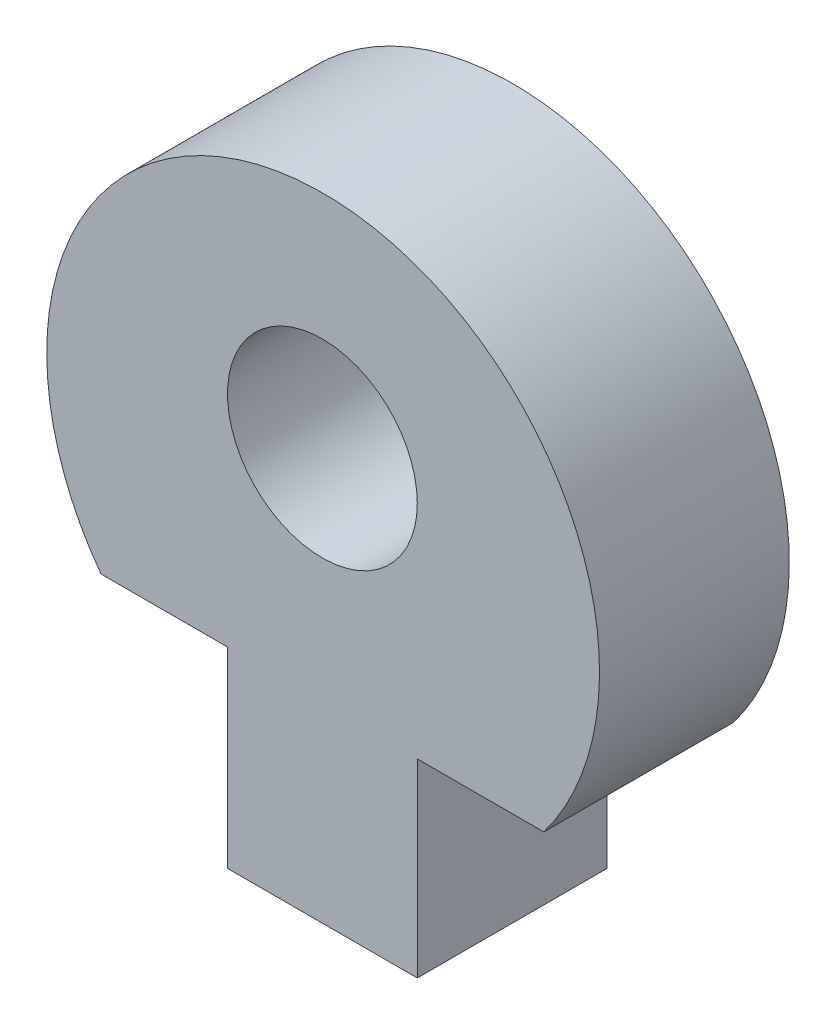
ISO-10303-21;
HEADER;
FILE_DESCRIPTION(('STEP AP214'),'2;1');
FILE_NAME('part.step','',(''),(''),'','','');
FILE_SCHEMA(('AUTOMOTIVE_DESIGN { 1 0 10303 214 1 1 1 1 }'));
ENDSEC;
DATA;
#1=APPLICATION_CONTEXT('core data for automotive mechanical design processes');
#2=APPLICATION_PROTOCOL_DEFINITION('international standard','automotive_design',2000,#1);
#3=PRODUCT_CONTEXT('',#1,'mechanical');
#4=PRODUCT('Part','Part','',(#3));
#5=PRODUCT_RELATED_PRODUCT_CATEGORY('part','',(#4));
#6=PRODUCT_DEFINITION_FORMATION('','',#4);
#7=PRODUCT_DEFINITION_CONTEXT('part definition',#1,'design');
#8=PRODUCT_DEFINITION('design','',#6,#7);
#9=PRODUCT_DEFINITION_SHAPE('','',#8);
#10=(LENGTH_UNIT() NAMED_UNIT(*) SI_UNIT(.MILLI.,.METRE.));
#11=(NAMED_UNIT(*) PLANE_ANGLE_UNIT() SI_UNIT($,.RADIAN.));
#12=(NAMED_UNIT(*) SI_UNIT($,.STERADIAN.) SOLID_ANGLE_UNIT());
#13=UNCERTAINTY_MEASURE_WITH_UNIT(LENGTH_MEASURE(1.E-05),#10,'distance_accuracy_value','');
#14=(GEOMETRIC_REPRESENTATION_CONTEXT(3) GLOBAL_UNCERTAINTY_ASSIGNED_CONTEXT((#13)) GLOBAL_UNIT_ASSIGNED_CONTEXT((#10,
#11,#12)) REPRESENTATION_CONTEXT('',''));
#15=CARTESIAN_POINT('',(0.,0.,0.));
#16=DIRECTION('',(0.,0.,1.));
#17=DIRECTION('',(1.,0.,0.));
#18=AXIS2_PLACEMENT_3D('',#15,#16,#17);
#19=CARTESIAN_POINT('',(52.9696021325009,23.6791068837143,6.));
#20=DIRECTION('',(0.,0.,1.));
#21=DIRECTION('',(1.,0.,0.));
#22=AXIS2_PLACEMENT_3D('',#19,#20,#21);
#23=PLANE('',#22);
#24=CARTESIAN_POINT('',(52.9696021325009,23.6791068837143,6.));
#25=DIRECTION('',(0.,0.,1.));
#26=DIRECTION('',(1.,0.,0.));
#27=AXIS2_PLACEMENT_3D('',#24,#25,#26);
#28=CIRCLE('',#27,8.73848553487772);
#29=CARTESIAN_POINT('',(59.9465121909599,18.4175619129437,6.));
#30=VERTEX_POINT('',#29);
#31=CARTESIAN_POINT('',(45.9465121909599,18.4793629365287,6.));
#32=VERTEX_POINT('',#31);
#33=EDGE_CURVE('E174',#30,#32,#28,.T.);
#34=ORIENTED_EDGE('',*,*,#33,.T.);
#35=DIRECTION('',(1.,0.,0.));
#36=VECTOR('',#35,1.);
#37=CARTESIAN_POINT('',(45.9465121909599,18.4793629365287,6.));
#38=LINE('',#37,#36);
#39=CARTESIAN_POINT('',(49.9465121909599,18.4793629365287,6.));
#40=VERTEX_POINT('',#39);
#41=EDGE_CURVE('E117',#32,#40,#38,.T.);
#42=ORIENTED_EDGE('',*,*,#41,.T.);
#43=DIRECTION('',(0.,1.,0.));
#44=VECTOR('',#43,1.);
#45=CARTESIAN_POINT('',(49.9465121909599,12.4175619129437,6.));
#46=LINE('',#45,#44);
#47=CARTESIAN_POINT('',(49.9465121909599,12.4175619129437,6.));
#48=VERTEX_POINT('',#47);
#49=EDGE_CURVE('E143',#48,#40,#46,.T.);
#50=ORIENTED_EDGE('',*,*,#49,.F.);
#51=DIRECTION('',(-1.,0.,0.));
#52=VECTOR('',#51,1.);
#53=CARTESIAN_POINT('',(55.9465121909599,12.4175619129437,6.));
#54=LINE('',#53,#52);
#55=CARTESIAN_POINT('',(55.9465121909599,12.4175619129437,6.));
#56=VERTEX_POINT('',#55);
#57=EDGE_CURVE('E129',#56,#48,#54,.T.);
#58=ORIENTED_EDGE('',*,*,#57,.F.);
#59=DIRECTION('',(0.,-1.,0.));
#60=VECTOR('',#59,1.);
#61=CARTESIAN_POINT('',(55.9465121909599,18.4175619129437,6.));
#62=LINE('',#61,#60);
#63=CARTESIAN_POINT('',(55.9465121909599,18.4175619129437,6.));
#64=VERTEX_POINT('',#63);
#65=EDGE_CURVE('E141',#64,#56,#62,.T.);
#66=ORIENTED_EDGE('',*,*,#65,.F.);
#67=DIRECTION('',(1.,0.,0.));
#68=VECTOR('',#67,1.);
#69=CARTESIAN_POINT('',(55.9465121909599,18.4175619129437,6.));
#70=LINE('',#69,#68);
#71=EDGE_CURVE('E84',#64,#30,#70,.T.);
#72=ORIENTED_EDGE('',*,*,#71,.T.);
#73=EDGE_LOOP('',(#34,#42,#50,#58,#66,#72));
#74=FACE_BOUND('',#73,.T.);
#75=CARTESIAN_POINT('',(52.9465121909599,25.4175619129442,6.));
#76=DIRECTION('',(0.,0.,1.));
#77=DIRECTION('',(1.,0.,0.));
#78=AXIS2_PLACEMENT_3D('',#75,#76,#77);
#79=CIRCLE('',#78,3.);
#80=CARTESIAN_POINT('',(55.9465121909599,25.4175619129442,6.));
#81=VERTEX_POINT('',#80);
#82=EDGE_CURVE('E159',#81,#81,#79,.T.);
#83=ORIENTED_EDGE('',*,*,#82,.F.);
#84=EDGE_LOOP('',(#83));
#85=FACE_BOUND('',#84,.T.);
#86=ADVANCED_FACE('F66',(#74,#85),#23,.T.);
#87=CARTESIAN_POINT('',(52.9696021325009,23.6791068837143,0.));
#88=DIRECTION('',(0.,0.,1.));
#89=DIRECTION('',(1.,0.,0.));
#90=AXIS2_PLACEMENT_3D('',#87,#88,#89);
#91=PLANE('',#90);
#92=CARTESIAN_POINT('',(52.9696021325009,23.6791068837143,0.));
#93=DIRECTION('',(0.,0.,1.));
#94=DIRECTION('',(1.,0.,0.));
#95=AXIS2_PLACEMENT_3D('',#92,#93,#94);
#96=CIRCLE('',#95,8.73848553487772);
#97=CARTESIAN_POINT('',(59.9465121909599,18.4175619129437,0.));
#98=VERTEX_POINT('',#97);
#99=CARTESIAN_POINT('',(45.9465121909599,18.4793629365287,0.));
#100=VERTEX_POINT('',#99);
#101=EDGE_CURVE('E154',#98,#100,#96,.T.);
#102=ORIENTED_EDGE('',*,*,#101,.F.);
#103=DIRECTION('',(1.,0.,0.));
#104=VECTOR('',#103,1.);
#105=CARTESIAN_POINT('',(55.9465121909599,18.4175619129437,0.));
#106=LINE('',#105,#104);
#107=CARTESIAN_POINT('',(55.9465121909599,18.4175619129437,0.));
#108=VERTEX_POINT('',#107);
#109=EDGE_CURVE('E109',#108,#98,#106,.T.);
#110=ORIENTED_EDGE('',*,*,#109,.F.);
#111=DIRECTION('',(0.,-1.,0.));
#112=VECTOR('',#111,1.);
#113=CARTESIAN_POINT('',(55.9465121909599,18.4175619129437,0.));
#114=LINE('',#113,#112);
#115=CARTESIAN_POINT('',(55.9465121909599,12.4175619129437,0.));
#116=VERTEX_POINT('',#115);
#117=EDGE_CURVE('E169',#108,#116,#114,.T.);
#118=ORIENTED_EDGE('',*,*,#117,.T.);
#119=DIRECTION('',(-1.,0.,0.));
#120=VECTOR('',#119,1.);
#121=CARTESIAN_POINT('',(55.9465121909599,12.4175619129437,0.));
#122=LINE('',#121,#120);
#123=CARTESIAN_POINT('',(49.9465121909599,12.4175619129437,0.));
#124=VERTEX_POINT('',#123);
#125=EDGE_CURVE('E131',#116,#124,#122,.T.);
#126=ORIENTED_EDGE('',*,*,#125,.T.);
#127=DIRECTION('',(0.,1.,0.));
#128=VECTOR('',#127,1.);
#129=CARTESIAN_POINT('',(49.9465121909599,12.4175619129437,0.));
#130=LINE('',#129,#128);
#131=CARTESIAN_POINT('',(49.9465121909599,18.4793629365287,0.));
#132=VERTEX_POINT('',#131);
#133=EDGE_CURVE('E163',#124,#132,#130,.T.);
#134=ORIENTED_EDGE('',*,*,#133,.T.);
#135=DIRECTION('',(1.,0.,0.));
#136=VECTOR('',#135,1.);
#137=CARTESIAN_POINT('',(45.9465121909599,18.4793629365287,0.));
#138=LINE('',#137,#136);
#139=EDGE_CURVE('E158',#100,#132,#138,.T.);
#140=ORIENTED_EDGE('',*,*,#139,.F.);
#141=EDGE_LOOP('',(#102,#110,#118,#126,#134,#140));
#142=FACE_BOUND('',#141,.T.);
#143=CARTESIAN_POINT('',(52.9465121909599,25.4175619129442,0.));
#144=DIRECTION('',(0.,0.,1.));
#145=DIRECTION('',(1.,0.,0.));
#146=AXIS2_PLACEMENT_3D('',#143,#144,#145);
#147=CIRCLE('',#146,3.);
#148=CARTESIAN_POINT('',(55.9465121909599,25.4175619129442,0.));
#149=VERTEX_POINT('',#148);
#150=EDGE_CURVE('E274',#149,#149,#147,.T.);
#151=ORIENTED_EDGE('',*,*,#150,.T.);
#152=EDGE_LOOP('',(#151));
#153=FACE_BOUND('',#152,.T.);
#154=ADVANCED_FACE('F188',(#142,#153),#91,.F.);
#155=CARTESIAN_POINT('',(52.9696021325009,23.6791068837143,6.));
#156=DIRECTION('',(0.,0.,-1.));
#157=DIRECTION('',(-1.,0.,0.));
#158=AXIS2_PLACEMENT_3D('',#155,#156,#157);
#159=CYLINDRICAL_SURFACE('',#158,8.73848553487772);
#160=ORIENTED_EDGE('',*,*,#101,.T.);
#161=DIRECTION('',(0.,0.,-1.));
#162=VECTOR('',#161,1.);
#163=CARTESIAN_POINT('',(45.9465121909599,18.4793629365287,6.));
#164=LINE('',#163,#162);
#165=EDGE_CURVE('E12',#32,#100,#164,.T.);
#166=ORIENTED_EDGE('',*,*,#165,.F.);
#167=ORIENTED_EDGE('',*,*,#33,.F.);
#168=DIRECTION('',(0.,0.,-1.));
#169=VECTOR('',#168,1.);
#170=CARTESIAN_POINT('',(59.9465121909599,18.4175619129437,6.));
#171=LINE('',#170,#169);
#172=EDGE_CURVE('E150',#30,#98,#171,.T.);
#173=ORIENTED_EDGE('',*,*,#172,.T.);
#174=EDGE_LOOP('',(#160,#166,#167,#173));
#175=FACE_BOUND('',#174,.T.);
#176=ADVANCED_FACE('F68',(#175),#159,.T.);
#177=CARTESIAN_POINT('',(45.9465121909599,18.4793629365287,6.));
#178=DIRECTION('',(0.,1.,0.));
#179=DIRECTION('',(0.,0.,1.));
#180=AXIS2_PLACEMENT_3D('',#177,#178,#179);
#181=PLANE('',#180);
#182=ORIENTED_EDGE('',*,*,#139,.T.);
#183=DIRECTION('',(0.,0.,-1.));
#184=VECTOR('',#183,1.);
#185=CARTESIAN_POINT('',(49.9465121909599,18.4793629365287,6.));
#186=LINE('',#185,#184);
#187=EDGE_CURVE('E76',#40,#132,#186,.T.);
#188=ORIENTED_EDGE('',*,*,#187,.F.);
#189=ORIENTED_EDGE('',*,*,#41,.F.);
#190=ORIENTED_EDGE('',*,*,#165,.T.);
#191=EDGE_LOOP('',(#182,#188,#189,#190));
#192=FACE_BOUND('',#191,.T.);
#193=ADVANCED_FACE('F184',(#192),#181,.F.);
#194=CARTESIAN_POINT('',(49.9465121909599,12.4175619129437,6.));
#195=DIRECTION('',(-1.,0.,0.));
#196=DIRECTION('',(0.,0.,1.));
#197=AXIS2_PLACEMENT_3D('',#194,#195,#196);
#198=PLANE('',#197);
#199=ORIENTED_EDGE('',*,*,#133,.F.);
#200=DIRECTION('',(0.,0.,-1.));
#201=VECTOR('',#200,1.);
#202=CARTESIAN_POINT('',(49.9465121909599,12.4175619129437,6.));
#203=LINE('',#202,#201);
#204=EDGE_CURVE('E137',#48,#124,#203,.T.);
#205=ORIENTED_EDGE('',*,*,#204,.F.);
#206=ORIENTED_EDGE('',*,*,#49,.T.);
#207=ORIENTED_EDGE('',*,*,#187,.T.);
#208=EDGE_LOOP('',(#199,#205,#206,#207));
#209=FACE_BOUND('',#208,.T.);
#210=ADVANCED_FACE('F183',(#209),#198,.T.);
#211=CARTESIAN_POINT('',(55.9465121909599,12.4175619129437,6.));
#212=DIRECTION('',(0.,-1.,0.));
#213=DIRECTION('',(0.,0.,-1.));
#214=AXIS2_PLACEMENT_3D('',#211,#212,#213);
#215=PLANE('',#214);
#216=ORIENTED_EDGE('',*,*,#125,.F.);
#217=DIRECTION('',(0.,0.,-1.));
#218=VECTOR('',#217,1.);
#219=CARTESIAN_POINT('',(55.9465121909599,12.4175619129437,6.));
#220=LINE('',#219,#218);
#221=EDGE_CURVE('E126',#56,#116,#220,.T.);
#222=ORIENTED_EDGE('',*,*,#221,.F.);
#223=ORIENTED_EDGE('',*,*,#57,.T.);
#224=ORIENTED_EDGE('',*,*,#204,.T.);
#225=EDGE_LOOP('',(#216,#222,#223,#224));
#226=FACE_BOUND('',#225,.T.);
#227=ADVANCED_FACE('F128',(#226),#215,.T.);
#228=CARTESIAN_POINT('',(55.9465121909599,18.4175619129437,6.));
#229=DIRECTION('',(1.,0.,0.));
#230=DIRECTION('',(0.,0.,-1.));
#231=AXIS2_PLACEMENT_3D('',#228,#229,#230);
#232=PLANE('',#231);
#233=ORIENTED_EDGE('',*,*,#117,.F.);
#234=DIRECTION('',(0.,0.,-1.));
#235=VECTOR('',#234,1.);
#236=CARTESIAN_POINT('',(55.9465121909599,18.4175619129437,6.));
#237=LINE('',#236,#235);
#238=EDGE_CURVE('E106',#64,#108,#237,.T.);
#239=ORIENTED_EDGE('',*,*,#238,.F.);
#240=ORIENTED_EDGE('',*,*,#65,.T.);
#241=ORIENTED_EDGE('',*,*,#221,.T.);
#242=EDGE_LOOP('',(#233,#239,#240,#241));
#243=FACE_BOUND('',#242,.T.);
#244=ADVANCED_FACE('F146',(#243),#232,.T.);
#245=CARTESIAN_POINT('',(55.9465121909599,18.4175619129437,6.));
#246=DIRECTION('',(0.,1.,0.));
#247=DIRECTION('',(0.,0.,1.));
#248=AXIS2_PLACEMENT_3D('',#245,#246,#247);
#249=PLANE('',#248);
#250=ORIENTED_EDGE('',*,*,#109,.T.);
#251=ORIENTED_EDGE('',*,*,#172,.F.);
#252=ORIENTED_EDGE('',*,*,#71,.F.);
#253=ORIENTED_EDGE('',*,*,#238,.T.);
#254=EDGE_LOOP('',(#250,#251,#252,#253));
#255=FACE_BOUND('',#254,.T.);
#256=ADVANCED_FACE('F192',(#255),#249,.F.);
#257=CARTESIAN_POINT('',(52.9465121909599,25.4175619129442,6.));
#258=DIRECTION('',(0.,0.,-1.));
#259=DIRECTION('',(-1.,0.,0.));
#260=AXIS2_PLACEMENT_3D('',#257,#258,#259);
#261=CYLINDRICAL_SURFACE('',#260,3.);
#262=ORIENTED_EDGE('',*,*,#82,.T.);
#263=EDGE_LOOP('',(#262));
#264=FACE_BOUND('',#263,.T.);
#265=ORIENTED_EDGE('',*,*,#150,.F.);
#266=EDGE_LOOP('',(#265));
#267=FACE_BOUND('',#266,.T.);
#268=ADVANCED_FACE('F194',(#264,#267),#261,.F.);
#269=CLOSED_SHELL('',(#86,#154,#176,#193,#210,#227,#244,#256,#268));
#270=MANIFOLD_SOLID_BREP('B2',#269);
#271=ADVANCED_BREP_SHAPE_REPRESENTATION('',(#18,#270),#14);
#272=SHAPE_DEFINITION_REPRESENTATION(#9,#271);
ENDSEC;
END-ISO-10303-21;
